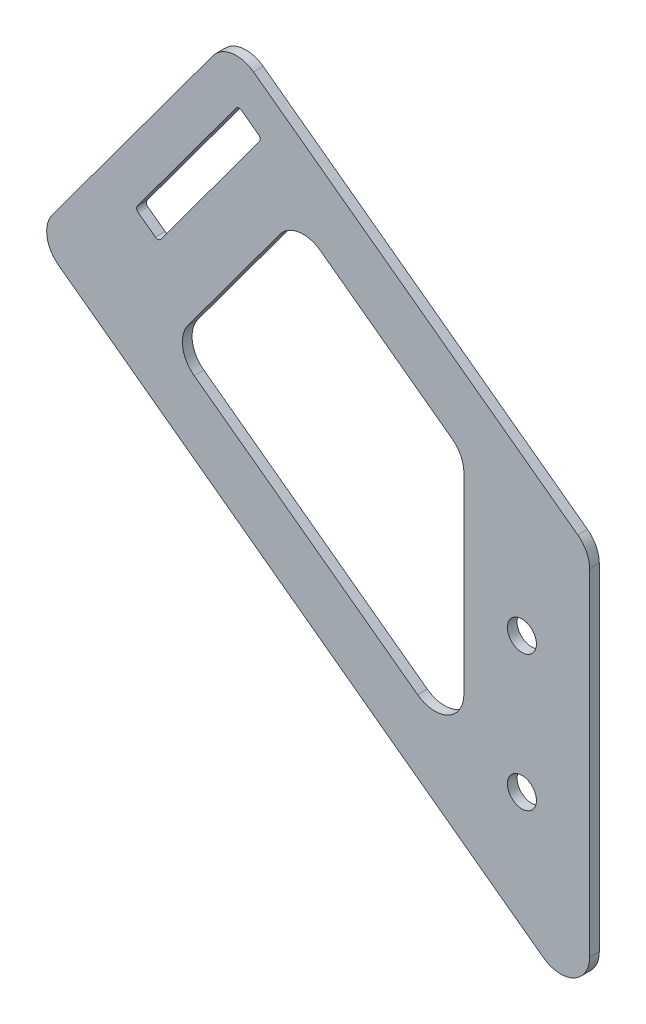
ISO-10303-21;
HEADER;
FILE_DESCRIPTION(('STEP AP214'),'2;1');
FILE_NAME('part.step','',(''),(''),'','','');
FILE_SCHEMA(('AUTOMOTIVE_DESIGN { 1 0 10303 214 1 1 1 1 }'));
ENDSEC;
DATA;
#1=APPLICATION_CONTEXT('core data for automotive mechanical design processes');
#2=APPLICATION_PROTOCOL_DEFINITION('international standard','automotive_design',2000,#1);
#3=PRODUCT_CONTEXT('',#1,'mechanical');
#4=PRODUCT('Part','Part','',(#3));
#5=PRODUCT_RELATED_PRODUCT_CATEGORY('part','',(#4));
#6=PRODUCT_DEFINITION_FORMATION('','',#4);
#7=PRODUCT_DEFINITION_CONTEXT('part definition',#1,'design');
#8=PRODUCT_DEFINITION('design','',#6,#7);
#9=PRODUCT_DEFINITION_SHAPE('','',#8);
#10=(LENGTH_UNIT() NAMED_UNIT(*) SI_UNIT(.MILLI.,.METRE.));
#11=(NAMED_UNIT(*) PLANE_ANGLE_UNIT() SI_UNIT($,.RADIAN.));
#12=(NAMED_UNIT(*) SI_UNIT($,.STERADIAN.) SOLID_ANGLE_UNIT());
#13=UNCERTAINTY_MEASURE_WITH_UNIT(LENGTH_MEASURE(1.E-05),#10,'distance_accuracy_value','');
#14=(GEOMETRIC_REPRESENTATION_CONTEXT(3) GLOBAL_UNCERTAINTY_ASSIGNED_CONTEXT((#13)) GLOBAL_UNIT_ASSIGNED_CONTEXT((#10,
#11,#12)) REPRESENTATION_CONTEXT('',''));
#15=CARTESIAN_POINT('',(0.,0.,0.));
#16=DIRECTION('',(0.,0.,1.));
#17=DIRECTION('',(1.,0.,0.));
#18=AXIS2_PLACEMENT_3D('',#15,#16,#17);
#19=CARTESIAN_POINT('',(136.403656021627,185.179026695265,3.175));
#20=DIRECTION('',(-0.593074905688188,-0.805147288539772,0.));
#21=DIRECTION('',(0.805147288539772,-0.593074905688188,0.));
#22=AXIS2_PLACEMENT_3D('',#19,#20,#21);
#23=PLANE('',#22);
#24=DIRECTION('',(-0.805147288539772,0.593074905688188,0.));
#25=VECTOR('',#24,1.);
#26=CARTESIAN_POINT('',(136.403656021627,185.179026695265,0.));
#27=LINE('',#26,#25);
#28=CARTESIAN_POINT('',(-155.846074694503,400.451417162125,0.));
#29=VERTEX_POINT('',#28);
#30=CARTESIAN_POINT('',(-161.470028504955,404.594045378358,0.));
#31=VERTEX_POINT('',#30);
#32=EDGE_CURVE('E230',#29,#31,#27,.T.);
#33=ORIENTED_EDGE('',*,*,#32,.T.);
#34=DIRECTION('',(0.,0.,-1.));
#35=VECTOR('',#34,1.);
#36=CARTESIAN_POINT('',(-161.470028504955,404.594045378358,3.175));
#37=LINE('',#36,#35);
#38=CARTESIAN_POINT('',(-161.470028504955,404.594045378358,3.175));
#39=VERTEX_POINT('',#38);
#40=EDGE_CURVE('E209',#39,#31,#37,.T.);
#41=ORIENTED_EDGE('',*,*,#40,.F.);
#42=DIRECTION('',(-0.805147288539772,0.593074905688188,0.));
#43=VECTOR('',#42,1.);
#44=CARTESIAN_POINT('',(136.403656021627,185.179026695265,3.175));
#45=LINE('',#44,#43);
#46=CARTESIAN_POINT('',(-155.846074694503,400.451417162125,3.175));
#47=VERTEX_POINT('',#46);
#48=EDGE_CURVE('E217',#47,#39,#45,.T.);
#49=ORIENTED_EDGE('',*,*,#48,.F.);
#50=DIRECTION('',(0.,0.,-1.));
#51=VECTOR('',#50,1.);
#52=CARTESIAN_POINT('',(-155.846074694503,400.451417162125,3.175));
#53=LINE('',#52,#51);
#54=EDGE_CURVE('E390',#47,#29,#53,.T.);
#55=ORIENTED_EDGE('',*,*,#54,.T.);
#56=EDGE_LOOP('',(#33,#41,#49,#55));
#57=FACE_BOUND('',#56,.T.);
#58=ADVANCED_FACE('F41',(#57),#23,.F.);
#59=CARTESIAN_POINT('',(-160.716823374731,405.616582434804,3.175));
#60=DIRECTION('',(0.,0.,-1.));
#61=DIRECTION('',(-1.,0.,0.));
#62=AXIS2_PLACEMENT_3D('',#59,#60,#61);
#63=CYLINDRICAL_SURFACE('',#62,1.27000000000001);
#64=CARTESIAN_POINT('',(-160.716823374731,405.616582434804,0.));
#65=DIRECTION('',(0.,0.,1.));
#66=DIRECTION('',(1.,0.,0.));
#67=AXIS2_PLACEMENT_3D('',#64,#65,#66);
#68=CIRCLE('',#67,1.27000000000001);
#69=CARTESIAN_POINT('',(-161.739360431176,406.369787565028,0.));
#70=VERTEX_POINT('',#69);
#71=EDGE_CURVE('E425',#31,#70,#68,.F.);
#72=ORIENTED_EDGE('',*,*,#71,.T.);
#73=DIRECTION('',(0.,0.,-1.));
#74=VECTOR('',#73,1.);
#75=CARTESIAN_POINT('',(-161.739360431176,406.369787565028,3.175));
#76=LINE('',#75,#74);
#77=CARTESIAN_POINT('',(-161.739360431176,406.369787565028,3.175));
#78=VERTEX_POINT('',#77);
#79=EDGE_CURVE('E211',#78,#70,#76,.T.);
#80=ORIENTED_EDGE('',*,*,#79,.F.);
#81=CARTESIAN_POINT('',(-160.716823374731,405.616582434804,3.175));
#82=DIRECTION('',(0.,0.,1.));
#83=DIRECTION('',(1.,0.,0.));
#84=AXIS2_PLACEMENT_3D('',#81,#82,#83);
#85=CIRCLE('',#84,1.27000000000001);
#86=EDGE_CURVE('E204',#39,#78,#85,.F.);
#87=ORIENTED_EDGE('',*,*,#86,.F.);
#88=ORIENTED_EDGE('',*,*,#40,.T.);
#89=EDGE_LOOP('',(#72,#80,#87,#88));
#90=FACE_BOUND('',#89,.T.);
#91=ADVANCED_FACE('F207',(#90),#63,.F.);
#92=CARTESIAN_POINT('',(-298.896221583027,220.168223813321,3.175));
#93=DIRECTION('',(0.805147288539767,-0.593074905688195,0.));
#94=DIRECTION('',(0.593074905688195,0.805147288539767,0.));
#95=AXIS2_PLACEMENT_3D('',#92,#93,#94);
#96=PLANE('',#95);
#97=DIRECTION('',(-0.593074905688195,-0.805147288539767,0.));
#98=VECTOR('',#97,1.);
#99=CARTESIAN_POINT('',(-298.896221583027,220.168223813321,0.));
#100=LINE('',#99,#98);
#101=CARTESIAN_POINT('',(-129.351539831544,450.338880992184,0.));
#102=VERTEX_POINT('',#101);
#103=EDGE_CURVE('E428',#102,#70,#100,.T.);
#104=ORIENTED_EDGE('',*,*,#103,.F.);
#105=DIRECTION('',(0.,0.,-1.));
#106=VECTOR('',#105,1.);
#107=CARTESIAN_POINT('',(-129.351539831544,450.338880992184,3.175));
#108=LINE('',#107,#106);
#109=CARTESIAN_POINT('',(-129.351539831544,450.338880992184,3.175));
#110=VERTEX_POINT('',#109);
#111=EDGE_CURVE('E238',#110,#102,#108,.T.);
#112=ORIENTED_EDGE('',*,*,#111,.F.);
#113=DIRECTION('',(-0.593074905688195,-0.805147288539767,0.));
#114=VECTOR('',#113,1.);
#115=CARTESIAN_POINT('',(-298.896221583027,220.168223813321,3.175));
#116=LINE('',#115,#114);
#117=EDGE_CURVE('E216',#110,#78,#116,.T.);
#118=ORIENTED_EDGE('',*,*,#117,.T.);
#119=ORIENTED_EDGE('',*,*,#79,.T.);
#120=EDGE_LOOP('',(#104,#112,#118,#119));
#121=FACE_BOUND('',#120,.T.);
#122=ADVANCED_FACE('F476',(#121),#96,.T.);
#123=CARTESIAN_POINT('',(-128.329002775098,449.58567586196,3.175));
#124=DIRECTION('',(0.,0.,-1.));
#125=DIRECTION('',(-1.,0.,0.));
#126=AXIS2_PLACEMENT_3D('',#123,#124,#125);
#127=CYLINDRICAL_SURFACE('',#126,1.27000000000003);
#128=CARTESIAN_POINT('',(-128.329002775098,449.58567586196,0.));
#129=DIRECTION('',(0.,0.,1.));
#130=DIRECTION('',(1.,0.,0.));
#131=AXIS2_PLACEMENT_3D('',#128,#129,#130);
#132=CIRCLE('',#131,1.27000000000003);
#133=CARTESIAN_POINT('',(-127.575797644874,450.608212918406,0.));
#134=VERTEX_POINT('',#133);
#135=EDGE_CURVE('E432',#102,#134,#132,.F.);
#136=ORIENTED_EDGE('',*,*,#135,.T.);
#137=DIRECTION('',(0.,0.,-1.));
#138=VECTOR('',#137,1.);
#139=CARTESIAN_POINT('',(-127.575797644874,450.608212918406,3.175));
#140=LINE('',#139,#138);
#141=CARTESIAN_POINT('',(-127.575797644874,450.608212918406,3.175));
#142=VERTEX_POINT('',#141);
#143=EDGE_CURVE('E464',#142,#134,#140,.T.);
#144=ORIENTED_EDGE('',*,*,#143,.F.);
#145=CARTESIAN_POINT('',(-128.329002775098,449.58567586196,3.175));
#146=DIRECTION('',(0.,0.,1.));
#147=DIRECTION('',(1.,0.,0.));
#148=AXIS2_PLACEMENT_3D('',#145,#146,#147);
#149=CIRCLE('',#148,1.27000000000003);
#150=EDGE_CURVE('E374',#110,#142,#149,.F.);
#151=ORIENTED_EDGE('',*,*,#150,.F.);
#152=ORIENTED_EDGE('',*,*,#111,.T.);
#153=EDGE_LOOP('',(#136,#144,#151,#152));
#154=FACE_BOUND('',#153,.T.);
#155=ADVANCED_FACE('F470',(#154),#127,.F.);
#156=CARTESIAN_POINT('',(170.297886881707,231.193194235311,3.175));
#157=DIRECTION('',(-0.593074905688191,-0.805147288539769,0.));
#158=DIRECTION('',(0.805147288539769,-0.593074905688191,0.));
#159=AXIS2_PLACEMENT_3D('',#156,#157,#158);
#160=PLANE('',#159);
#161=DIRECTION('',(-0.80514728853977,0.593074905688192,0.));
#162=VECTOR('',#161,1.);
#163=CARTESIAN_POINT('',(170.297886881707,231.193194235311,0.));
#164=LINE('',#163,#162);
#165=CARTESIAN_POINT('',(-121.951843834423,446.465584702173,0.));
#166=VERTEX_POINT('',#165);
#167=EDGE_CURVE('E436',#166,#134,#164,.T.);
#168=ORIENTED_EDGE('',*,*,#167,.F.);
#169=DIRECTION('',(0.,0.,-1.));
#170=VECTOR('',#169,1.);
#171=CARTESIAN_POINT('',(-121.951843834423,446.465584702173,3.175));
#172=LINE('',#171,#170);
#173=CARTESIAN_POINT('',(-121.951843834423,446.465584702173,3.175));
#174=VERTEX_POINT('',#173);
#175=EDGE_CURVE('E461',#174,#166,#172,.T.);
#176=ORIENTED_EDGE('',*,*,#175,.F.);
#177=DIRECTION('',(-0.80514728853977,0.593074905688192,0.));
#178=VECTOR('',#177,1.);
#179=CARTESIAN_POINT('',(170.297886881707,231.193194235311,3.175));
#180=LINE('',#179,#178);
#181=EDGE_CURVE('E377',#174,#142,#180,.T.);
#182=ORIENTED_EDGE('',*,*,#181,.T.);
#183=ORIENTED_EDGE('',*,*,#143,.T.);
#184=EDGE_LOOP('',(#168,#176,#182,#183));
#185=FACE_BOUND('',#184,.T.);
#186=ADVANCED_FACE('F486',(#185),#160,.T.);
#187=CARTESIAN_POINT('',(-122.705048964647,445.443047645728,3.175));
#188=DIRECTION('',(0.,0.,-1.));
#189=DIRECTION('',(-1.,0.,0.));
#190=AXIS2_PLACEMENT_3D('',#187,#188,#189);
#191=CYLINDRICAL_SURFACE('',#190,1.27000000000002);
#192=CARTESIAN_POINT('',(-122.705048964647,445.443047645728,0.));
#193=DIRECTION('',(0.,0.,1.));
#194=DIRECTION('',(1.,0.,0.));
#195=AXIS2_PLACEMENT_3D('',#192,#193,#194);
#196=CIRCLE('',#195,1.27000000000002);
#197=CARTESIAN_POINT('',(-121.682511908201,444.689842515503,0.));
#198=VERTEX_POINT('',#197);
#199=EDGE_CURVE('E440',#166,#198,#196,.F.);
#200=ORIENTED_EDGE('',*,*,#199,.T.);
#201=DIRECTION('',(0.,0.,-1.));
#202=VECTOR('',#201,1.);
#203=CARTESIAN_POINT('',(-121.682511908201,444.689842515503,3.175));
#204=LINE('',#203,#202);
#205=CARTESIAN_POINT('',(-121.682511908201,444.689842515503,3.175));
#206=VERTEX_POINT('',#205);
#207=EDGE_CURVE('E458',#206,#198,#204,.T.);
#208=ORIENTED_EDGE('',*,*,#207,.F.);
#209=CARTESIAN_POINT('',(-122.705048964647,445.443047645728,3.175));
#210=DIRECTION('',(0.,0.,1.));
#211=DIRECTION('',(1.,0.,0.));
#212=AXIS2_PLACEMENT_3D('',#209,#210,#211);
#213=CIRCLE('',#212,1.27000000000002);
#214=EDGE_CURVE('E381',#174,#206,#213,.F.);
#215=ORIENTED_EDGE('',*,*,#214,.F.);
#216=ORIENTED_EDGE('',*,*,#175,.T.);
#217=EDGE_LOOP('',(#200,#208,#215,#216));
#218=FACE_BOUND('',#217,.T.);
#219=ADVANCED_FACE('F489',(#218),#191,.F.);
#220=CARTESIAN_POINT('',(-291.227193659685,214.51918533664,3.175));
#221=DIRECTION('',(-0.805147288539766,0.593074905688196,0.));
#222=DIRECTION('',(-0.593074905688196,-0.805147288539766,0.));
#223=AXIS2_PLACEMENT_3D('',#220,#221,#222);
#224=PLANE('',#223);
#225=DIRECTION('',(0.593074905688196,0.805147288539766,0.));
#226=VECTOR('',#225,1.);
#227=CARTESIAN_POINT('',(-291.227193659685,214.51918533664,0.));
#228=LINE('',#227,#226);
#229=CARTESIAN_POINT('',(-154.070332507834,400.720749088347,0.));
#230=VERTEX_POINT('',#229);
#231=EDGE_CURVE('E444',#230,#198,#228,.T.);
#232=ORIENTED_EDGE('',*,*,#231,.F.);
#233=DIRECTION('',(0.,0.,-1.));
#234=VECTOR('',#233,1.);
#235=CARTESIAN_POINT('',(-154.070332507834,400.720749088347,3.175));
#236=LINE('',#235,#234);
#237=CARTESIAN_POINT('',(-154.070332507834,400.720749088347,3.175));
#238=VERTEX_POINT('',#237);
#239=EDGE_CURVE('E455',#238,#230,#236,.T.);
#240=ORIENTED_EDGE('',*,*,#239,.F.);
#241=DIRECTION('',(0.593074905688196,0.805147288539766,0.));
#242=VECTOR('',#241,1.);
#243=CARTESIAN_POINT('',(-291.227193659685,214.51918533664,3.175));
#244=LINE('',#243,#242);
#245=EDGE_CURVE('E384',#238,#206,#244,.T.);
#246=ORIENTED_EDGE('',*,*,#245,.T.);
#247=ORIENTED_EDGE('',*,*,#207,.T.);
#248=EDGE_LOOP('',(#232,#240,#246,#247));
#249=FACE_BOUND('',#248,.T.);
#250=ADVANCED_FACE('F482',(#249),#224,.T.);
#251=CARTESIAN_POINT('',(-54.6100000000139,0.,3.175));
#252=DIRECTION('',(1.,0.,0.));
#253=DIRECTION('',(0.,1.,0.));
#254=AXIS2_PLACEMENT_3D('',#251,#252,#253);
#255=PLANE('',#254);
#256=DIRECTION('',(0.,-1.,0.));
#257=VECTOR('',#256,1.);
#258=CARTESIAN_POINT('',(-54.6100000000139,0.,0.));
#259=LINE('',#258,#257);
#260=CARTESIAN_POINT('',(-54.6100000000139,384.160563101391,0.));
#261=VERTEX_POINT('',#260);
#262=CARTESIAN_POINT('',(-54.6100000000139,321.066517175791,0.));
#263=VERTEX_POINT('',#262);
#264=EDGE_CURVE('E414',#261,#263,#259,.T.);
#265=ORIENTED_EDGE('',*,*,#264,.T.);
#266=DIRECTION('',(0.,0.,-1.));
#267=VECTOR('',#266,1.);
#268=CARTESIAN_POINT('',(-54.6100000000139,321.066517175791,3.175));
#269=LINE('',#268,#267);
#270=CARTESIAN_POINT('',(-54.6100000000139,321.066517175791,3.175));
#271=VERTEX_POINT('',#270);
#272=EDGE_CURVE('E256',#263,#271,#269,.F.);
#273=ORIENTED_EDGE('',*,*,#272,.T.);
#274=DIRECTION('',(0.,-1.,0.));
#275=VECTOR('',#274,1.);
#276=CARTESIAN_POINT('',(-54.6100000000139,0.,3.175));
#277=LINE('',#276,#275);
#278=CARTESIAN_POINT('',(-54.6100000000139,384.160563101391,3.175));
#279=VERTEX_POINT('',#278);
#280=EDGE_CURVE('E595',#279,#271,#277,.T.);
#281=ORIENTED_EDGE('',*,*,#280,.F.);
#282=DIRECTION('',(0.,0.,-1.));
#283=VECTOR('',#282,1.);
#284=CARTESIAN_POINT('',(-54.6100000000139,384.160563101391,0.));
#285=LINE('',#284,#283);
#286=EDGE_CURVE('E252',#279,#261,#285,.T.);
#287=ORIENTED_EDGE('',*,*,#286,.T.);
#288=EDGE_LOOP('',(#265,#273,#281,#287));
#289=FACE_BOUND('',#288,.T.);
#290=ADVANCED_FACE('F496',(#289),#255,.F.);
#291=CARTESIAN_POINT('',(125.105579068267,169.840970848579,3.175));
#292=DIRECTION('',(-0.593074905688196,-0.805147288539766,0.));
#293=DIRECTION('',(0.805147288539766,-0.593074905688196,0.));
#294=AXIS2_PLACEMENT_3D('',#291,#292,#293);
#295=PLANE('',#294);
#296=DIRECTION('',(-0.805147288539766,0.593074905688196,0.));
#297=VECTOR('',#296,1.);
#298=CARTESIAN_POINT('',(125.105579068267,169.840970848579,0.));
#299=LINE('',#298,#297);
#300=CARTESIAN_POINT('',(-69.784038476694,313.39748925245,0.));
#301=VERTEX_POINT('',#300);
#302=CARTESIAN_POINT('',(-143.114530821394,367.413040755179,0.));
#303=VERTEX_POINT('',#302);
#304=EDGE_CURVE('E353',#301,#303,#299,.T.);
#305=ORIENTED_EDGE('',*,*,#304,.T.);
#306=DIRECTION('',(0.,0.,-1.));
#307=VECTOR('',#306,1.);
#308=CARTESIAN_POINT('',(-143.114530821394,367.413040755179,3.175));
#309=LINE('',#308,#307);
#310=CARTESIAN_POINT('',(-143.114530821394,367.413040755179,3.175));
#311=VERTEX_POINT('',#310);
#312=EDGE_CURVE('E249',#303,#311,#309,.F.);
#313=ORIENTED_EDGE('',*,*,#312,.T.);
#314=DIRECTION('',(-0.805147288539766,0.593074905688196,0.));
#315=VECTOR('',#314,1.);
#316=CARTESIAN_POINT('',(125.105579068267,169.840970848579,3.175));
#317=LINE('',#316,#315);
#318=CARTESIAN_POINT('',(-69.784038476694,313.39748925245,3.175));
#319=VERTEX_POINT('',#318);
#320=EDGE_CURVE('E368',#319,#311,#317,.T.);
#321=ORIENTED_EDGE('',*,*,#320,.F.);
#322=DIRECTION('',(0.,0.,-1.));
#323=VECTOR('',#322,1.);
#324=CARTESIAN_POINT('',(-69.784038476694,313.39748925245,0.));
#325=LINE('',#324,#323);
#326=EDGE_CURVE('E245',#319,#301,#325,.T.);
#327=ORIENTED_EDGE('',*,*,#326,.T.);
#328=EDGE_LOOP('',(#305,#313,#321,#327));
#329=FACE_BOUND('',#328,.T.);
#330=ADVANCED_FACE('F514',(#329),#295,.F.);
#331=CARTESIAN_POINT('',(-275.889137813002,203.22110838328,3.175));
#332=DIRECTION('',(0.805147288539766,-0.593074905688195,0.));
#333=DIRECTION('',(0.593074905688196,0.805147288539767,0.));
#334=AXIS2_PLACEMENT_3D('',#331,#332,#333);
#335=PLANE('',#334);
#336=DIRECTION('',(-0.593074905688196,-0.805147288539767,0.));
#337=VECTOR('',#336,1.);
#338=CARTESIAN_POINT('',(-275.889137813002,203.22110838328,3.175));
#339=LINE('',#338,#337);
#340=CARTESIAN_POINT('',(-115.006315059095,421.63258941302,3.175));
#341=VERTEX_POINT('',#340);
#342=CARTESIAN_POINT('',(-145.134520268055,380.7311071552,3.175));
#343=VERTEX_POINT('',#342);
#344=EDGE_CURVE('E361',#341,#343,#339,.T.);
#345=ORIENTED_EDGE('',*,*,#344,.T.);
#346=DIRECTION('',(0.,0.,-1.));
#347=VECTOR('',#346,1.);
#348=CARTESIAN_POINT('',(-145.134520268055,380.7311071552,3.175));
#349=LINE('',#348,#347);
#350=CARTESIAN_POINT('',(-145.134520268055,380.7311071552,0.));
#351=VERTEX_POINT('',#350);
#352=EDGE_CURVE('E236',#343,#351,#349,.T.);
#353=ORIENTED_EDGE('',*,*,#352,.T.);
#354=DIRECTION('',(-0.593074905688196,-0.805147288539767,0.));
#355=VECTOR('',#354,1.);
#356=CARTESIAN_POINT('',(-275.889137813002,203.22110838328,0.));
#357=LINE('',#356,#355);
#358=CARTESIAN_POINT('',(-115.006315059095,421.63258941302,0.));
#359=VERTEX_POINT('',#358);
#360=EDGE_CURVE('E341',#359,#351,#357,.T.);
#361=ORIENTED_EDGE('',*,*,#360,.F.);
#362=DIRECTION('',(0.,0.,-1.));
#363=VECTOR('',#362,1.);
#364=CARTESIAN_POINT('',(-115.006315059095,421.63258941302,3.175));
#365=LINE('',#364,#363);
#366=EDGE_CURVE('E232',#359,#341,#365,.F.);
#367=ORIENTED_EDGE('',*,*,#366,.T.);
#368=EDGE_LOOP('',(#345,#353,#361,#367));
#369=FACE_BOUND('',#368,.T.);
#370=ADVANCED_FACE('F349',(#369),#335,.T.);
#371=CARTESIAN_POINT('',(-309.121592147482,227.700275115561,3.175));
#372=DIRECTION('',(0.805147288539767,-0.593074905688195,0.));
#373=DIRECTION('',(0.593074905688195,0.805147288539767,0.));
#374=AXIS2_PLACEMENT_3D('',#371,#372,#373);
#375=PLANE('',#374);
#376=DIRECTION('',(-0.593074905688195,-0.805147288539767,0.));
#377=VECTOR('',#376,1.);
#378=CARTESIAN_POINT('',(-309.121592147482,227.700275115561,3.175));
#379=LINE('',#378,#377);
#380=CARTESIAN_POINT('',(-136.940692440215,461.449811991984,3.175));
#381=VERTEX_POINT('',#380);
#382=CARTESIAN_POINT('',(-189.665051555895,389.872218040798,3.175));
#383=VERTEX_POINT('',#382);
#384=EDGE_CURVE('E574',#381,#383,#379,.T.);
#385=ORIENTED_EDGE('',*,*,#384,.F.);
#386=DIRECTION('',(0.,0.,-1.));
#387=VECTOR('',#386,1.);
#388=CARTESIAN_POINT('',(-136.940692440215,461.449811991984,3.175));
#389=LINE('',#388,#387);
#390=CARTESIAN_POINT('',(-136.940692440215,461.449811991984,0.));
#391=VERTEX_POINT('',#390);
#392=EDGE_CURVE('E312',#381,#391,#389,.T.);
#393=ORIENTED_EDGE('',*,*,#392,.T.);
#394=DIRECTION('',(-0.593074905688195,-0.805147288539767,0.));
#395=VECTOR('',#394,1.);
#396=CARTESIAN_POINT('',(-309.121592147482,227.700275115561,0.));
#397=LINE('',#396,#395);
#398=CARTESIAN_POINT('',(-189.665051555895,389.872218040798,0.));
#399=VERTEX_POINT('',#398);
#400=EDGE_CURVE('E399',#391,#399,#397,.T.);
#401=ORIENTED_EDGE('',*,*,#400,.T.);
#402=DIRECTION('',(0.,0.,-1.));
#403=VECTOR('',#402,1.);
#404=CARTESIAN_POINT('',(-189.665051555895,389.872218040798,3.175));
#405=LINE('',#404,#403);
#406=EDGE_CURVE('E309',#399,#383,#405,.F.);
#407=ORIENTED_EDGE('',*,*,#406,.T.);
#408=EDGE_LOOP('',(#385,#393,#401,#407));
#409=FACE_BOUND('',#408,.T.);
#410=ADVANCED_FACE('F513',(#409),#375,.F.);
#411=CARTESIAN_POINT('',(113.807502114907,154.502915001896,3.175));
#412=DIRECTION('',(0.593074905688195,0.805147288539767,0.));
#413=DIRECTION('',(-0.805147288539767,0.593074905688195,0.));
#414=AXIS2_PLACEMENT_3D('',#411,#412,#413);
#415=PLANE('',#414);
#416=DIRECTION('',(0.805147288539767,-0.593074905688195,0.));
#417=VECTOR('',#416,1.);
#418=CARTESIAN_POINT('',(113.807502114907,154.502915001896,0.));
#419=LINE('',#418,#417);
#420=CARTESIAN_POINT('',(-187.645062109234,376.554151640777,0.));
#421=VERTEX_POINT('',#420);
#422=CARTESIAN_POINT('',(-28.5090384766937,259.333882069191,0.));
#423=VERTEX_POINT('',#422);
#424=EDGE_CURVE('E403',#421,#423,#419,.T.);
#425=ORIENTED_EDGE('',*,*,#424,.T.);
#426=DIRECTION('',(0.,0.,-1.));
#427=VECTOR('',#426,1.);
#428=CARTESIAN_POINT('',(-28.5090384766937,259.333882069191,3.175));
#429=LINE('',#428,#427);
#430=CARTESIAN_POINT('',(-28.5090384766937,259.333882069191,3.175));
#431=VERTEX_POINT('',#430);
#432=EDGE_CURVE('E289',#423,#431,#429,.F.);
#433=ORIENTED_EDGE('',*,*,#432,.T.);
#434=DIRECTION('',(0.805147288539767,-0.593074905688195,0.));
#435=VECTOR('',#434,1.);
#436=CARTESIAN_POINT('',(113.807502114907,154.502915001896,3.175));
#437=LINE('',#436,#435);
#438=CARTESIAN_POINT('',(-187.645062109234,376.554151640777,3.175));
#439=VERTEX_POINT('',#438);
#440=EDGE_CURVE('E580',#439,#431,#437,.T.);
#441=ORIENTED_EDGE('',*,*,#440,.F.);
#442=DIRECTION('',(0.,0.,-1.));
#443=VECTOR('',#442,1.);
#444=CARTESIAN_POINT('',(-187.645062109234,376.554151640777,3.175));
#445=LINE('',#444,#443);
#446=EDGE_CURVE('E285',#439,#421,#445,.T.);
#447=ORIENTED_EDGE('',*,*,#446,.T.);
#448=EDGE_LOOP('',(#425,#433,#441,#447));
#449=FACE_BOUND('',#448,.T.);
#450=ADVANCED_FACE('F526',(#449),#415,.F.);
#451=CARTESIAN_POINT('',(-13.3350000000136,0.,3.175));
#452=DIRECTION('',(-1.,0.,0.));
#453=DIRECTION('',(0.,0.,1.));
#454=AXIS2_PLACEMENT_3D('',#451,#452,#453);
#455=PLANE('',#454);
#456=DIRECTION('',(0.,1.,0.));
#457=VECTOR('',#456,1.);
#458=CARTESIAN_POINT('',(-13.3350000000136,0.,3.175));
#459=LINE('',#458,#457);
#460=CARTESIAN_POINT('',(-13.3350000000136,267.002909992532,3.175));
#461=VERTEX_POINT('',#460);
#462=CARTESIAN_POINT('',(-13.3350000000136,377.417490362331,3.175));
#463=VERTEX_POINT('',#462);
#464=EDGE_CURVE('E585',#461,#463,#459,.T.);
#465=ORIENTED_EDGE('',*,*,#464,.F.);
#466=DIRECTION('',(0.,0.,-1.));
#467=VECTOR('',#466,1.);
#468=CARTESIAN_POINT('',(-13.3350000000136,267.002909992532,3.175));
#469=LINE('',#468,#467);
#470=CARTESIAN_POINT('',(-13.3350000000136,267.002909992532,0.));
#471=VERTEX_POINT('',#470);
#472=EDGE_CURVE('E269',#461,#471,#469,.T.);
#473=ORIENTED_EDGE('',*,*,#472,.T.);
#474=DIRECTION('',(0.,1.,0.));
#475=VECTOR('',#474,1.);
#476=CARTESIAN_POINT('',(-13.3350000000136,0.,0.));
#477=LINE('',#476,#475);
#478=CARTESIAN_POINT('',(-13.3350000000136,377.417490362331,0.));
#479=VERTEX_POINT('',#478);
#480=EDGE_CURVE('E407',#471,#479,#477,.T.);
#481=ORIENTED_EDGE('',*,*,#480,.T.);
#482=DIRECTION('',(0.,0.,-1.));
#483=VECTOR('',#482,1.);
#484=CARTESIAN_POINT('',(-13.3350000000136,377.417490362331,3.175));
#485=LINE('',#484,#483);
#486=EDGE_CURVE('E266',#479,#463,#485,.F.);
#487=ORIENTED_EDGE('',*,*,#486,.T.);
#488=EDGE_LOOP('',(#465,#473,#481,#487));
#489=FACE_BOUND('',#488,.T.);
#490=ADVANCED_FACE('F510',(#489),#455,.F.);
#491=CARTESIAN_POINT('',(166.531861230587,226.080508953081,3.175));
#492=DIRECTION('',(0.593074905688196,0.805147288539766,0.));
#493=DIRECTION('',(-0.805147288539766,0.593074905688196,0.));
#494=AXIS2_PLACEMENT_3D('',#491,#492,#493);
#495=PLANE('',#494);
#496=DIRECTION('',(0.805147288539766,-0.593074905688196,0.));
#497=VECTOR('',#496,1.);
#498=CARTESIAN_POINT('',(166.531861230587,226.080508953081,0.));
#499=LINE('',#498,#497);
#500=CARTESIAN_POINT('',(-101.688248659074,423.652578859681,0.));
#501=VERTEX_POINT('',#500);
#502=CARTESIAN_POINT('',(-58.4859615233339,391.829591024732,0.));
#503=VERTEX_POINT('',#502);
#504=EDGE_CURVE('E343',#501,#503,#499,.T.);
#505=ORIENTED_EDGE('',*,*,#504,.T.);
#506=DIRECTION('',(0.,0.,-1.));
#507=VECTOR('',#506,1.);
#508=CARTESIAN_POINT('',(-58.4859615233339,391.829591024732,3.175));
#509=LINE('',#508,#507);
#510=CARTESIAN_POINT('',(-58.4859615233339,391.829591024732,3.175));
#511=VERTEX_POINT('',#510);
#512=EDGE_CURVE('E263',#503,#511,#509,.F.);
#513=ORIENTED_EDGE('',*,*,#512,.T.);
#514=DIRECTION('',(0.805147288539766,-0.593074905688196,0.));
#515=VECTOR('',#514,1.);
#516=CARTESIAN_POINT('',(166.531861230587,226.080508953081,3.175));
#517=LINE('',#516,#515);
#518=CARTESIAN_POINT('',(-101.688248659074,423.652578859681,3.175));
#519=VERTEX_POINT('',#518);
#520=EDGE_CURVE('E227',#519,#511,#517,.T.);
#521=ORIENTED_EDGE('',*,*,#520,.F.);
#522=DIRECTION('',(0.,0.,-1.));
#523=VECTOR('',#522,1.);
#524=CARTESIAN_POINT('',(-101.688248659074,423.652578859681,3.175));
#525=LINE('',#524,#523);
#526=EDGE_CURVE('E259',#519,#501,#525,.T.);
#527=ORIENTED_EDGE('',*,*,#526,.T.);
#528=EDGE_LOOP('',(#505,#513,#521,#527));
#529=FACE_BOUND('',#528,.T.);
#530=ADVANCED_FACE('F363',(#529),#495,.F.);
#531=CARTESIAN_POINT('',(177.829938183947,241.418564799764,3.175));
#532=DIRECTION('',(-0.593074905688196,-0.805147288539766,0.));
#533=DIRECTION('',(0.805147288539767,-0.593074905688196,0.));
#534=AXIS2_PLACEMENT_3D('',#531,#532,#533);
#535=PLANE('',#534);
#536=DIRECTION('',(-0.805147288539766,0.593074905688196,0.));
#537=VECTOR('',#536,1.);
#538=CARTESIAN_POINT('',(177.829938183947,241.418564799764,3.175));
#539=LINE('',#538,#537);
#540=CARTESIAN_POINT('',(-17.2109615233336,385.086518285673,3.175));
#541=VERTEX_POINT('',#540);
#542=CARTESIAN_POINT('',(-123.622626040193,463.469801438645,3.175));
#543=VERTEX_POINT('',#542);
#544=EDGE_CURVE('E576',#541,#543,#539,.T.);
#545=ORIENTED_EDGE('',*,*,#544,.F.);
#546=DIRECTION('',(0.,0.,-1.));
#547=VECTOR('',#546,1.);
#548=CARTESIAN_POINT('',(-17.2109615233336,385.086518285673,3.175));
#549=LINE('',#548,#547);
#550=CARTESIAN_POINT('',(-17.2109615233336,385.086518285673,0.));
#551=VERTEX_POINT('',#550);
#552=EDGE_CURVE('E305',#541,#551,#549,.T.);
#553=ORIENTED_EDGE('',*,*,#552,.T.);
#554=DIRECTION('',(-0.805147288539766,0.593074905688196,0.));
#555=VECTOR('',#554,1.);
#556=CARTESIAN_POINT('',(177.829938183947,241.418564799764,0.));
#557=LINE('',#556,#555);
#558=CARTESIAN_POINT('',(-123.622626040193,463.469801438645,0.));
#559=VERTEX_POINT('',#558);
#560=EDGE_CURVE('E411',#551,#559,#557,.T.);
#561=ORIENTED_EDGE('',*,*,#560,.T.);
#562=DIRECTION('',(0.,0.,-1.));
#563=VECTOR('',#562,1.);
#564=CARTESIAN_POINT('',(-123.622626040193,463.469801438645,3.175));
#565=LINE('',#564,#563);
#566=EDGE_CURVE('E57',#559,#543,#565,.F.);
#567=ORIENTED_EDGE('',*,*,#566,.T.);
#568=EDGE_LOOP('',(#545,#553,#561,#567));
#569=FACE_BOUND('',#568,.T.);
#570=ADVANCED_FACE('F509',(#569),#535,.F.);
#571=CARTESIAN_POINT('',(-35.5600000000141,302.837639338074,3.175));
#572=DIRECTION('',(0.,0.,-1.));
#573=DIRECTION('',(-1.,0.,0.));
#574=AXIS2_PLACEMENT_3D('',#571,#572,#573);
#575=CYLINDRICAL_SURFACE('',#574,4.7625000000168);
#576=CARTESIAN_POINT('',(-35.5600000000141,302.837639338074,3.175));
#577=DIRECTION('',(0.,0.,1.));
#578=DIRECTION('',(1.,0.,0.));
#579=AXIS2_PLACEMENT_3D('',#576,#577,#578);
#580=CIRCLE('',#579,4.7625000000168);
#581=CARTESIAN_POINT('',(-30.7974999999973,302.837639338074,3.175));
#582=VERTEX_POINT('',#581);
#583=EDGE_CURVE('E581',#582,#582,#580,.T.);
#584=ORIENTED_EDGE('',*,*,#583,.T.);
#585=EDGE_LOOP('',(#584));
#586=FACE_BOUND('',#585,.T.);
#587=CARTESIAN_POINT('',(-35.5600000000141,302.837639338074,0.));
#588=DIRECTION('',(0.,0.,1.));
#589=DIRECTION('',(1.,0.,0.));
#590=AXIS2_PLACEMENT_3D('',#587,#588,#589);
#591=CIRCLE('',#590,4.7625000000168);
#592=CARTESIAN_POINT('',(-30.7974999999973,302.837639338074,0.));
#593=VERTEX_POINT('',#592);
#594=EDGE_CURVE('E395',#593,#593,#591,.T.);
#595=ORIENTED_EDGE('',*,*,#594,.F.);
#596=EDGE_LOOP('',(#595));
#597=FACE_BOUND('',#596,.T.);
#598=ADVANCED_FACE('F523',(#586,#597),#575,.F.);
#599=CARTESIAN_POINT('',(-35.5600000000139,347.287639338074,3.175));
#600=DIRECTION('',(0.,0.,-1.));
#601=DIRECTION('',(-1.,0.,0.));
#602=AXIS2_PLACEMENT_3D('',#599,#600,#601);
#603=CYLINDRICAL_SURFACE('',#602,4.76250000001677);
#604=CARTESIAN_POINT('',(-35.5600000000139,347.287639338074,3.175));
#605=DIRECTION('',(0.,0.,1.));
#606=DIRECTION('',(1.,0.,0.));
#607=AXIS2_PLACEMENT_3D('',#604,#605,#606);
#608=CIRCLE('',#607,4.76250000001677);
#609=CARTESIAN_POINT('',(-30.7974999999972,347.287639338074,3.175));
#610=VERTEX_POINT('',#609);
#611=EDGE_CURVE('E452',#610,#610,#608,.T.);
#612=ORIENTED_EDGE('',*,*,#611,.T.);
#613=EDGE_LOOP('',(#612));
#614=FACE_BOUND('',#613,.T.);
#615=CARTESIAN_POINT('',(-35.5600000000139,347.287639338074,0.));
#616=DIRECTION('',(0.,0.,1.));
#617=DIRECTION('',(1.,0.,0.));
#618=AXIS2_PLACEMENT_3D('',#615,#616,#617);
#619=CIRCLE('',#618,4.76250000001677);
#620=CARTESIAN_POINT('',(-30.7974999999972,347.287639338074,0.));
#621=VERTEX_POINT('',#620);
#622=EDGE_CURVE('E391',#621,#621,#619,.T.);
#623=ORIENTED_EDGE('',*,*,#622,.F.);
#624=EDGE_LOOP('',(#623));
#625=FACE_BOUND('',#624,.T.);
#626=ADVANCED_FACE('F536',(#614,#625),#603,.F.);
#627=CARTESIAN_POINT('',(-155.092869564279,401.473954218571,3.175));
#628=DIRECTION('',(0.,0.,-1.));
#629=DIRECTION('',(-1.,0.,0.));
#630=AXIS2_PLACEMENT_3D('',#627,#628,#629);
#631=CYLINDRICAL_SURFACE('',#630,1.26999999999998);
#632=CARTESIAN_POINT('',(-155.092869564279,401.473954218571,0.));
#633=DIRECTION('',(0.,0.,1.));
#634=DIRECTION('',(1.,0.,0.));
#635=AXIS2_PLACEMENT_3D('',#632,#633,#634);
#636=CIRCLE('',#635,1.26999999999998);
#637=EDGE_CURVE('E448',#29,#230,#636,.T.);
#638=ORIENTED_EDGE('',*,*,#637,.F.);
#639=ORIENTED_EDGE('',*,*,#54,.F.);
#640=CARTESIAN_POINT('',(-155.092869564279,401.473954218571,3.175));
#641=DIRECTION('',(0.,0.,1.));
#642=DIRECTION('',(1.,0.,0.));
#643=AXIS2_PLACEMENT_3D('',#640,#641,#642);
#644=CIRCLE('',#643,1.26999999999998);
#645=EDGE_CURVE('E224',#47,#238,#644,.T.);
#646=ORIENTED_EDGE('',*,*,#645,.T.);
#647=ORIENTED_EDGE('',*,*,#239,.T.);
#648=EDGE_LOOP('',(#638,#639,#646,#647));
#649=FACE_BOUND('',#648,.T.);
#650=ADVANCED_FACE('F479',(#649),#631,.F.);
#651=CARTESIAN_POINT('',(0.,0.,3.175));
#652=DIRECTION('',(0.,0.,1.));
#653=DIRECTION('',(1.,0.,0.));
#654=AXIS2_PLACEMENT_3D('',#651,#652,#653);
#655=PLANE('',#654);
#656=ORIENTED_EDGE('',*,*,#611,.F.);
#657=EDGE_LOOP('',(#656));
#658=FACE_BOUND('',#657,.T.);
#659=ORIENTED_EDGE('',*,*,#583,.F.);
#660=EDGE_LOOP('',(#659));
#661=FACE_BOUND('',#660,.T.);
#662=ORIENTED_EDGE('',*,*,#440,.T.);
#663=CARTESIAN_POINT('',(-22.8600000000136,267.002909992532,3.175));
#664=DIRECTION('',(0.,0.,1.));
#665=DIRECTION('',(1.,0.,0.));
#666=AXIS2_PLACEMENT_3D('',#663,#664,#665);
#667=CIRCLE('',#666,9.525);
#668=EDGE_CURVE('E300',#431,#461,#667,.T.);
#669=ORIENTED_EDGE('',*,*,#668,.T.);
#670=ORIENTED_EDGE('',*,*,#464,.T.);
#671=CARTESIAN_POINT('',(-22.8600000000136,377.417490362331,3.175));
#672=DIRECTION('',(0.,0.,1.));
#673=DIRECTION('',(1.,0.,0.));
#674=AXIS2_PLACEMENT_3D('',#671,#672,#673);
#675=CIRCLE('',#674,9.525);
#676=EDGE_CURVE('E64',#463,#541,#675,.T.);
#677=ORIENTED_EDGE('',*,*,#676,.T.);
#678=ORIENTED_EDGE('',*,*,#544,.T.);
#679=CARTESIAN_POINT('',(-129.271664516873,455.800773515304,3.175));
#680=DIRECTION('',(0.,0.,1.));
#681=DIRECTION('',(1.,0.,0.));
#682=AXIS2_PLACEMENT_3D('',#679,#680,#681);
#683=CIRCLE('',#682,9.525);
#684=EDGE_CURVE('E295',#543,#381,#683,.T.);
#685=ORIENTED_EDGE('',*,*,#684,.T.);
#686=ORIENTED_EDGE('',*,*,#384,.T.);
#687=CARTESIAN_POINT('',(-181.996023632554,384.223179564118,3.175));
#688=DIRECTION('',(0.,0.,1.));
#689=DIRECTION('',(1.,0.,0.));
#690=AXIS2_PLACEMENT_3D('',#687,#688,#689);
#691=CIRCLE('',#690,9.525);
#692=EDGE_CURVE('E292',#383,#439,#691,.T.);
#693=ORIENTED_EDGE('',*,*,#692,.T.);
#694=EDGE_LOOP('',(#662,#669,#670,#677,#678,#685,#686,#693));
#695=FACE_BOUND('',#694,.T.);
#696=ORIENTED_EDGE('',*,*,#520,.T.);
#697=CARTESIAN_POINT('',(-64.1350000000139,384.160563101391,3.175));
#698=DIRECTION('',(0.,0.,1.));
#699=DIRECTION('',(1.,0.,0.));
#700=AXIS2_PLACEMENT_3D('',#697,#698,#699);
#701=CIRCLE('',#700,9.525);
#702=EDGE_CURVE('E331',#511,#279,#701,.F.);
#703=ORIENTED_EDGE('',*,*,#702,.T.);
#704=ORIENTED_EDGE('',*,*,#280,.T.);
#705=CARTESIAN_POINT('',(-64.1350000000139,321.066517175791,3.175));
#706=DIRECTION('',(0.,0.,1.));
#707=DIRECTION('',(1.,0.,0.));
#708=AXIS2_PLACEMENT_3D('',#705,#706,#707);
#709=CIRCLE('',#708,9.525);
#710=EDGE_CURVE('E325',#271,#319,#709,.F.);
#711=ORIENTED_EDGE('',*,*,#710,.T.);
#712=ORIENTED_EDGE('',*,*,#320,.T.);
#713=CARTESIAN_POINT('',(-137.465492344714,375.08206867852,3.175));
#714=DIRECTION('',(0.,0.,1.));
#715=DIRECTION('',(1.,0.,0.));
#716=AXIS2_PLACEMENT_3D('',#713,#714,#715);
#717=CIRCLE('',#716,9.525);
#718=EDGE_CURVE('E319',#311,#343,#717,.F.);
#719=ORIENTED_EDGE('',*,*,#718,.T.);
#720=ORIENTED_EDGE('',*,*,#344,.F.);
#721=CARTESIAN_POINT('',(-107.337287135754,415.98355093634,3.175));
#722=DIRECTION('',(0.,0.,1.));
#723=DIRECTION('',(1.,0.,0.));
#724=AXIS2_PLACEMENT_3D('',#721,#722,#723);
#725=CIRCLE('',#724,9.525);
#726=EDGE_CURVE('E11',#341,#519,#725,.F.);
#727=ORIENTED_EDGE('',*,*,#726,.T.);
#728=EDGE_LOOP('',(#696,#703,#704,#711,#712,#719,#720,#727));
#729=FACE_BOUND('',#728,.T.);
#730=ORIENTED_EDGE('',*,*,#48,.T.);
#731=ORIENTED_EDGE('',*,*,#86,.T.);
#732=ORIENTED_EDGE('',*,*,#117,.F.);
#733=ORIENTED_EDGE('',*,*,#150,.T.);
#734=ORIENTED_EDGE('',*,*,#181,.F.);
#735=ORIENTED_EDGE('',*,*,#214,.T.);
#736=ORIENTED_EDGE('',*,*,#245,.F.);
#737=ORIENTED_EDGE('',*,*,#645,.F.);
#738=EDGE_LOOP('',(#730,#731,#732,#733,#734,#735,#736,#737));
#739=FACE_BOUND('',#738,.T.);
#740=ADVANCED_FACE('F221',(#658,#661,#695,#729,#739),#655,.T.);
#741=CARTESIAN_POINT('',(0.,0.,0.));
#742=DIRECTION('',(0.,0.,1.));
#743=DIRECTION('',(1.,0.,0.));
#744=AXIS2_PLACEMENT_3D('',#741,#742,#743);
#745=PLANE('',#744);
#746=ORIENTED_EDGE('',*,*,#622,.T.);
#747=EDGE_LOOP('',(#746));
#748=FACE_BOUND('',#747,.T.);
#749=ORIENTED_EDGE('',*,*,#594,.T.);
#750=EDGE_LOOP('',(#749));
#751=FACE_BOUND('',#750,.T.);
#752=ORIENTED_EDGE('',*,*,#480,.F.);
#753=CARTESIAN_POINT('',(-22.8600000000136,267.002909992532,0.));
#754=DIRECTION('',(0.,0.,1.));
#755=DIRECTION('',(1.,0.,0.));
#756=AXIS2_PLACEMENT_3D('',#753,#754,#755);
#757=CIRCLE('',#756,9.525);
#758=EDGE_CURVE('E282',#471,#423,#757,.F.);
#759=ORIENTED_EDGE('',*,*,#758,.T.);
#760=ORIENTED_EDGE('',*,*,#424,.F.);
#761=CARTESIAN_POINT('',(-181.996023632554,384.223179564118,0.));
#762=DIRECTION('',(0.,0.,1.));
#763=DIRECTION('',(1.,0.,0.));
#764=AXIS2_PLACEMENT_3D('',#761,#762,#763);
#765=CIRCLE('',#764,9.525);
#766=EDGE_CURVE('E273',#421,#399,#765,.F.);
#767=ORIENTED_EDGE('',*,*,#766,.T.);
#768=ORIENTED_EDGE('',*,*,#400,.F.);
#769=CARTESIAN_POINT('',(-129.271664516873,455.800773515304,0.));
#770=DIRECTION('',(0.,0.,1.));
#771=DIRECTION('',(1.,0.,0.));
#772=AXIS2_PLACEMENT_3D('',#769,#770,#771);
#773=CIRCLE('',#772,9.525);
#774=EDGE_CURVE('E276',#391,#559,#773,.F.);
#775=ORIENTED_EDGE('',*,*,#774,.T.);
#776=ORIENTED_EDGE('',*,*,#560,.F.);
#777=CARTESIAN_POINT('',(-22.8600000000136,377.417490362331,0.));
#778=DIRECTION('',(0.,0.,1.));
#779=DIRECTION('',(1.,0.,0.));
#780=AXIS2_PLACEMENT_3D('',#777,#778,#779);
#781=CIRCLE('',#780,9.525);
#782=EDGE_CURVE('E279',#551,#479,#781,.F.);
#783=ORIENTED_EDGE('',*,*,#782,.T.);
#784=EDGE_LOOP('',(#752,#759,#760,#767,#768,#775,#776,#783));
#785=FACE_BOUND('',#784,.T.);
#786=ORIENTED_EDGE('',*,*,#264,.F.);
#787=CARTESIAN_POINT('',(-64.1350000000139,384.160563101391,0.));
#788=DIRECTION('',(0.,0.,1.));
#789=DIRECTION('',(1.,0.,0.));
#790=AXIS2_PLACEMENT_3D('',#787,#788,#789);
#791=CIRCLE('',#790,9.525);
#792=EDGE_CURVE('E328',#261,#503,#791,.T.);
#793=ORIENTED_EDGE('',*,*,#792,.T.);
#794=ORIENTED_EDGE('',*,*,#504,.F.);
#795=CARTESIAN_POINT('',(-107.337287135754,415.98355093634,0.));
#796=DIRECTION('',(0.,0.,1.));
#797=DIRECTION('',(1.,0.,0.));
#798=AXIS2_PLACEMENT_3D('',#795,#796,#797);
#799=CIRCLE('',#798,9.525);
#800=EDGE_CURVE('E50',#501,#359,#799,.T.);
#801=ORIENTED_EDGE('',*,*,#800,.T.);
#802=ORIENTED_EDGE('',*,*,#360,.T.);
#803=CARTESIAN_POINT('',(-137.465492344714,375.08206867852,0.));
#804=DIRECTION('',(0.,0.,1.));
#805=DIRECTION('',(1.,0.,0.));
#806=AXIS2_PLACEMENT_3D('',#803,#804,#805);
#807=CIRCLE('',#806,9.525);
#808=EDGE_CURVE('E316',#351,#303,#807,.T.);
#809=ORIENTED_EDGE('',*,*,#808,.T.);
#810=ORIENTED_EDGE('',*,*,#304,.F.);
#811=CARTESIAN_POINT('',(-64.1350000000139,321.066517175791,0.));
#812=DIRECTION('',(0.,0.,1.));
#813=DIRECTION('',(1.,0.,0.));
#814=AXIS2_PLACEMENT_3D('',#811,#812,#813);
#815=CIRCLE('',#814,9.525);
#816=EDGE_CURVE('E322',#301,#263,#815,.T.);
#817=ORIENTED_EDGE('',*,*,#816,.T.);
#818=EDGE_LOOP('',(#786,#793,#794,#801,#802,#809,#810,#817));
#819=FACE_BOUND('',#818,.T.);
#820=ORIENTED_EDGE('',*,*,#32,.F.);
#821=ORIENTED_EDGE('',*,*,#637,.T.);
#822=ORIENTED_EDGE('',*,*,#231,.T.);
#823=ORIENTED_EDGE('',*,*,#199,.F.);
#824=ORIENTED_EDGE('',*,*,#167,.T.);
#825=ORIENTED_EDGE('',*,*,#135,.F.);
#826=ORIENTED_EDGE('',*,*,#103,.T.);
#827=ORIENTED_EDGE('',*,*,#71,.F.);
#828=EDGE_LOOP('',(#820,#821,#822,#823,#824,#825,#826,#827));
#829=FACE_BOUND('',#828,.T.);
#830=ADVANCED_FACE('F339',(#748,#751,#785,#819,#829),#745,.F.);
#831=CARTESIAN_POINT('',(-137.465492344714,375.08206867852,3.175));
#832=DIRECTION('',(0.,0.,-1.));
#833=DIRECTION('',(-1.,0.,0.));
#834=AXIS2_PLACEMENT_3D('',#831,#832,#833);
#835=CYLINDRICAL_SURFACE('',#834,9.525);
#836=ORIENTED_EDGE('',*,*,#718,.F.);
#837=ORIENTED_EDGE('',*,*,#312,.F.);
#838=ORIENTED_EDGE('',*,*,#808,.F.);
#839=ORIENTED_EDGE('',*,*,#352,.F.);
#840=EDGE_LOOP('',(#836,#837,#838,#839));
#841=FACE_BOUND('',#840,.T.);
#842=ADVANCED_FACE('F541',(#841),#835,.F.);
#843=CARTESIAN_POINT('',(-64.1350000000139,321.066517175791,3.175));
#844=DIRECTION('',(0.,0.,1.));
#845=DIRECTION('',(1.,0.,0.));
#846=AXIS2_PLACEMENT_3D('',#843,#844,#845);
#847=CYLINDRICAL_SURFACE('',#846,9.525);
#848=ORIENTED_EDGE('',*,*,#710,.F.);
#849=ORIENTED_EDGE('',*,*,#272,.F.);
#850=ORIENTED_EDGE('',*,*,#816,.F.);
#851=ORIENTED_EDGE('',*,*,#326,.F.);
#852=EDGE_LOOP('',(#848,#849,#850,#851));
#853=FACE_BOUND('',#852,.T.);
#854=ADVANCED_FACE('F544',(#853),#847,.F.);
#855=CARTESIAN_POINT('',(-64.1350000000139,384.160563101391,3.175));
#856=DIRECTION('',(0.,0.,1.));
#857=DIRECTION('',(1.,0.,0.));
#858=AXIS2_PLACEMENT_3D('',#855,#856,#857);
#859=CYLINDRICAL_SURFACE('',#858,9.525);
#860=ORIENTED_EDGE('',*,*,#702,.F.);
#861=ORIENTED_EDGE('',*,*,#512,.F.);
#862=ORIENTED_EDGE('',*,*,#792,.F.);
#863=ORIENTED_EDGE('',*,*,#286,.F.);
#864=EDGE_LOOP('',(#860,#861,#862,#863));
#865=FACE_BOUND('',#864,.T.);
#866=ADVANCED_FACE('F548',(#865),#859,.F.);
#867=CARTESIAN_POINT('',(-107.337287135754,415.98355093634,3.175));
#868=DIRECTION('',(0.,0.,-1.));
#869=DIRECTION('',(-1.,0.,0.));
#870=AXIS2_PLACEMENT_3D('',#867,#868,#869);
#871=CYLINDRICAL_SURFACE('',#870,9.525);
#872=ORIENTED_EDGE('',*,*,#726,.F.);
#873=ORIENTED_EDGE('',*,*,#366,.F.);
#874=ORIENTED_EDGE('',*,*,#800,.F.);
#875=ORIENTED_EDGE('',*,*,#526,.F.);
#876=EDGE_LOOP('',(#872,#873,#874,#875));
#877=FACE_BOUND('',#876,.T.);
#878=ADVANCED_FACE('F356',(#877),#871,.F.);
#879=CARTESIAN_POINT('',(-22.8600000000136,267.002909992532,3.175));
#880=DIRECTION('',(0.,0.,-1.));
#881=DIRECTION('',(-1.,0.,0.));
#882=AXIS2_PLACEMENT_3D('',#879,#880,#881);
#883=CYLINDRICAL_SURFACE('',#882,9.525);
#884=ORIENTED_EDGE('',*,*,#668,.F.);
#885=ORIENTED_EDGE('',*,*,#432,.F.);
#886=ORIENTED_EDGE('',*,*,#758,.F.);
#887=ORIENTED_EDGE('',*,*,#472,.F.);
#888=EDGE_LOOP('',(#884,#885,#886,#887));
#889=FACE_BOUND('',#888,.T.);
#890=ADVANCED_FACE('F555',(#889),#883,.T.);
#891=CARTESIAN_POINT('',(-22.8600000000136,377.417490362331,3.175));
#892=DIRECTION('',(0.,0.,-1.));
#893=DIRECTION('',(-1.,0.,0.));
#894=AXIS2_PLACEMENT_3D('',#891,#892,#893);
#895=CYLINDRICAL_SURFACE('',#894,9.525);
#896=ORIENTED_EDGE('',*,*,#676,.F.);
#897=ORIENTED_EDGE('',*,*,#486,.F.);
#898=ORIENTED_EDGE('',*,*,#782,.F.);
#899=ORIENTED_EDGE('',*,*,#552,.F.);
#900=EDGE_LOOP('',(#896,#897,#898,#899));
#901=FACE_BOUND('',#900,.T.);
#902=ADVANCED_FACE('F558',(#901),#895,.T.);
#903=CARTESIAN_POINT('',(-129.271664516873,455.800773515304,3.175));
#904=DIRECTION('',(0.,0.,-1.));
#905=DIRECTION('',(-1.,0.,0.));
#906=AXIS2_PLACEMENT_3D('',#903,#904,#905);
#907=CYLINDRICAL_SURFACE('',#906,9.525);
#908=ORIENTED_EDGE('',*,*,#684,.F.);
#909=ORIENTED_EDGE('',*,*,#566,.F.);
#910=ORIENTED_EDGE('',*,*,#774,.F.);
#911=ORIENTED_EDGE('',*,*,#392,.F.);
#912=EDGE_LOOP('',(#908,#909,#910,#911));
#913=FACE_BOUND('',#912,.T.);
#914=ADVANCED_FACE('F561',(#913),#907,.T.);
#915=CARTESIAN_POINT('',(-181.996023632554,384.223179564118,3.175));
#916=DIRECTION('',(0.,0.,-1.));
#917=DIRECTION('',(-1.,0.,0.));
#918=AXIS2_PLACEMENT_3D('',#915,#916,#917);
#919=CYLINDRICAL_SURFACE('',#918,9.525);
#920=ORIENTED_EDGE('',*,*,#692,.F.);
#921=ORIENTED_EDGE('',*,*,#406,.F.);
#922=ORIENTED_EDGE('',*,*,#766,.F.);
#923=ORIENTED_EDGE('',*,*,#446,.F.);
#924=EDGE_LOOP('',(#920,#921,#922,#923));
#925=FACE_BOUND('',#924,.T.);
#926=ADVANCED_FACE('F43',(#925),#919,.T.);
#927=CLOSED_SHELL('',(#58,#91,#122,#155,#186,#219,#250,#290,#330,#370,#410,#450,#490,#530,#570,
#598,#626,#650,#740,#830,#842,#854,#866,#878,#890,#902,#914,#926));
#928=MANIFOLD_SOLID_BREP('B2',#927);
#929=ADVANCED_BREP_SHAPE_REPRESENTATION('',(#18,#928),#14);
#930=SHAPE_DEFINITION_REPRESENTATION(#9,#929);
ENDSEC;
END-ISO-10303-21;
